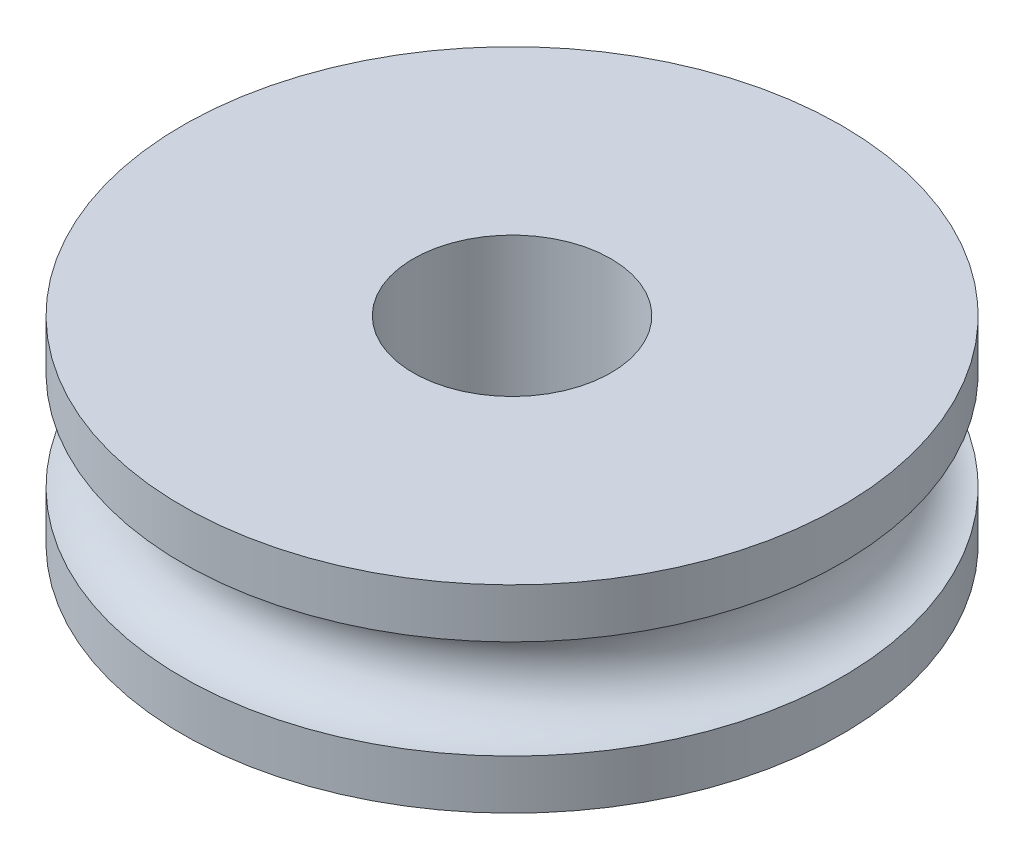
ISO-10303-21;
HEADER;
FILE_DESCRIPTION(('STEP AP214'),'2;1');
FILE_NAME('part.step','',(''),(''),'','','');
FILE_SCHEMA(('AUTOMOTIVE_DESIGN { 1 0 10303 214 1 1 1 1 }'));
ENDSEC;
DATA;
#1=APPLICATION_CONTEXT('core data for automotive mechanical design processes');
#2=APPLICATION_PROTOCOL_DEFINITION('international standard','automotive_design',2000,#1);
#3=PRODUCT_CONTEXT('',#1,'mechanical');
#4=PRODUCT('Part','Part','',(#3));
#5=PRODUCT_RELATED_PRODUCT_CATEGORY('part','',(#4));
#6=PRODUCT_DEFINITION_FORMATION('','',#4);
#7=PRODUCT_DEFINITION_CONTEXT('part definition',#1,'design');
#8=PRODUCT_DEFINITION('design','',#6,#7);
#9=PRODUCT_DEFINITION_SHAPE('','',#8);
#10=(LENGTH_UNIT() NAMED_UNIT(*) SI_UNIT(.MILLI.,.METRE.));
#11=(NAMED_UNIT(*) PLANE_ANGLE_UNIT() SI_UNIT($,.RADIAN.));
#12=(NAMED_UNIT(*) SI_UNIT($,.STERADIAN.) SOLID_ANGLE_UNIT());
#13=UNCERTAINTY_MEASURE_WITH_UNIT(LENGTH_MEASURE(1.E-05),#10,'distance_accuracy_value','');
#14=(GEOMETRIC_REPRESENTATION_CONTEXT(3) GLOBAL_UNCERTAINTY_ASSIGNED_CONTEXT((#13)) GLOBAL_UNIT_ASSIGNED_CONTEXT((#10,
#11,#12)) REPRESENTATION_CONTEXT('',''));
#15=CARTESIAN_POINT('',(0.,0.,0.));
#16=DIRECTION('',(0.,0.,1.));
#17=DIRECTION('',(1.,0.,0.));
#18=AXIS2_PLACEMENT_3D('',#15,#16,#17);
#19=CARTESIAN_POINT('',(0.,0.,0.));
#20=DIRECTION('',(0.,-1.,0.));
#21=DIRECTION('',(0.,0.,-1.));
#22=AXIS2_PLACEMENT_3D('',#19,#20,#21);
#23=CYLINDRICAL_SURFACE('',#22,5.);
#24=CARTESIAN_POINT('',(0.,0.749999999999999,0.));
#25=DIRECTION('',(0.,-1.,0.));
#26=DIRECTION('',(0.,0.,-1.));
#27=AXIS2_PLACEMENT_3D('',#24,#25,#26);
#28=CIRCLE('',#27,5.);
#29=CARTESIAN_POINT('',(0.,0.749999999999999,-5.));
#30=VERTEX_POINT('',#29);
#31=EDGE_CURVE('E60',#30,#30,#28,.T.);
#32=ORIENTED_EDGE('',*,*,#31,.F.);
#33=EDGE_LOOP('',(#32));
#34=FACE_BOUND('',#33,.T.);
#35=CARTESIAN_POINT('',(0.,1.5,0.));
#36=DIRECTION('',(0.,-1.,0.));
#37=DIRECTION('',(0.,0.,-1.));
#38=AXIS2_PLACEMENT_3D('',#35,#36,#37);
#39=CIRCLE('',#38,5.);
#40=CARTESIAN_POINT('',(0.,1.5,-5.));
#41=VERTEX_POINT('',#40);
#42=EDGE_CURVE('E10',#41,#41,#39,.T.);
#43=ORIENTED_EDGE('',*,*,#42,.T.);
#44=EDGE_LOOP('',(#43));
#45=FACE_BOUND('',#44,.T.);
#46=ADVANCED_FACE('F38',(#34,#45),#23,.T.);
#47=CARTESIAN_POINT('',(0.,1.5,1.5));
#48=DIRECTION('',(0.,-1.,0.));
#49=DIRECTION('',(0.,0.,-1.));
#50=AXIS2_PLACEMENT_3D('',#47,#48,#49);
#51=PLANE('',#50);
#52=ORIENTED_EDGE('',*,*,#42,.F.);
#53=EDGE_LOOP('',(#52));
#54=FACE_BOUND('',#53,.T.);
#55=CARTESIAN_POINT('',(0.,1.5,0.));
#56=DIRECTION('',(0.,-1.,0.));
#57=DIRECTION('',(0.,0.,-1.));
#58=AXIS2_PLACEMENT_3D('',#55,#56,#57);
#59=CIRCLE('',#58,1.5);
#60=CARTESIAN_POINT('',(0.,1.5,-1.5));
#61=VERTEX_POINT('',#60);
#62=EDGE_CURVE('E44',#61,#61,#59,.T.);
#63=ORIENTED_EDGE('',*,*,#62,.T.);
#64=EDGE_LOOP('',(#63));
#65=FACE_BOUND('',#64,.T.);
#66=ADVANCED_FACE('F67',(#54,#65),#51,.F.);
#67=CARTESIAN_POINT('',(0.,0.,0.));
#68=DIRECTION('',(0.,-1.,0.));
#69=DIRECTION('',(0.,0.,-1.));
#70=AXIS2_PLACEMENT_3D('',#67,#68,#69);
#71=CYLINDRICAL_SURFACE('',#70,1.5);
#72=ORIENTED_EDGE('',*,*,#62,.F.);
#73=EDGE_LOOP('',(#72));
#74=FACE_BOUND('',#73,.T.);
#75=CARTESIAN_POINT('',(0.,-1.5,0.));
#76=DIRECTION('',(0.,-1.,0.));
#77=DIRECTION('',(0.,0.,-1.));
#78=AXIS2_PLACEMENT_3D('',#75,#76,#77);
#79=CIRCLE('',#78,1.5);
#80=CARTESIAN_POINT('',(0.,-1.5,-1.5));
#81=VERTEX_POINT('',#80);
#82=EDGE_CURVE('E48',#81,#81,#79,.T.);
#83=ORIENTED_EDGE('',*,*,#82,.T.);
#84=EDGE_LOOP('',(#83));
#85=FACE_BOUND('',#84,.T.);
#86=ADVANCED_FACE('F71',(#74,#85),#71,.F.);
#87=CARTESIAN_POINT('',(0.,-1.5,5.));
#88=DIRECTION('',(0.,1.,0.));
#89=DIRECTION('',(0.,0.,1.));
#90=AXIS2_PLACEMENT_3D('',#87,#88,#89);
#91=PLANE('',#90);
#92=ORIENTED_EDGE('',*,*,#82,.F.);
#93=EDGE_LOOP('',(#92));
#94=FACE_BOUND('',#93,.T.);
#95=CARTESIAN_POINT('',(0.,-1.5,0.));
#96=DIRECTION('',(0.,-1.,0.));
#97=DIRECTION('',(0.,0.,-1.));
#98=AXIS2_PLACEMENT_3D('',#95,#96,#97);
#99=CIRCLE('',#98,5.);
#100=CARTESIAN_POINT('',(0.,-1.5,-5.));
#101=VERTEX_POINT('',#100);
#102=EDGE_CURVE('E52',#101,#101,#99,.T.);
#103=ORIENTED_EDGE('',*,*,#102,.T.);
#104=EDGE_LOOP('',(#103));
#105=FACE_BOUND('',#104,.T.);
#106=ADVANCED_FACE('F76',(#94,#105),#91,.F.);
#107=CARTESIAN_POINT('',(0.,0.,0.));
#108=DIRECTION('',(0.,-1.,0.));
#109=DIRECTION('',(0.,0.,-1.));
#110=AXIS2_PLACEMENT_3D('',#107,#108,#109);
#111=CYLINDRICAL_SURFACE('',#110,5.);
#112=ORIENTED_EDGE('',*,*,#102,.F.);
#113=EDGE_LOOP('',(#112));
#114=FACE_BOUND('',#113,.T.);
#115=CARTESIAN_POINT('',(0.,-0.75,0.));
#116=DIRECTION('',(0.,-1.,0.));
#117=DIRECTION('',(0.,0.,-1.));
#118=AXIS2_PLACEMENT_3D('',#115,#116,#117);
#119=CIRCLE('',#118,5.);
#120=CARTESIAN_POINT('',(0.,-0.75,-5.));
#121=VERTEX_POINT('',#120);
#122=EDGE_CURVE('E57',#121,#121,#119,.T.);
#123=ORIENTED_EDGE('',*,*,#122,.T.);
#124=EDGE_LOOP('',(#123));
#125=FACE_BOUND('',#124,.T.);
#126=ADVANCED_FACE('F82',(#114,#125),#111,.T.);
#127=CARTESIAN_POINT('',(0.,0.,0.));
#128=DIRECTION('',(0.,-1.,0.));
#129=DIRECTION('',(0.,0.,-1.));
#130=AXIS2_PLACEMENT_3D('',#127,#128,#129);
#131=TOROIDAL_SURFACE('',#130,5.,0.75);
#132=ORIENTED_EDGE('',*,*,#122,.F.);
#133=EDGE_LOOP('',(#132));
#134=FACE_BOUND('',#133,.T.);
#135=ORIENTED_EDGE('',*,*,#31,.T.);
#136=EDGE_LOOP('',(#135));
#137=FACE_BOUND('',#136,.T.);
#138=ADVANCED_FACE('F64',(#134,#137),#131,.F.);
#139=CLOSED_SHELL('',(#46,#66,#86,#106,#126,#138));
#140=MANIFOLD_SOLID_BREP('B2',#139);
#141=ADVANCED_BREP_SHAPE_REPRESENTATION('',(#18,#140),#14);
#142=SHAPE_DEFINITION_REPRESENTATION(#9,#141);
ENDSEC;
END-ISO-10303-21;
